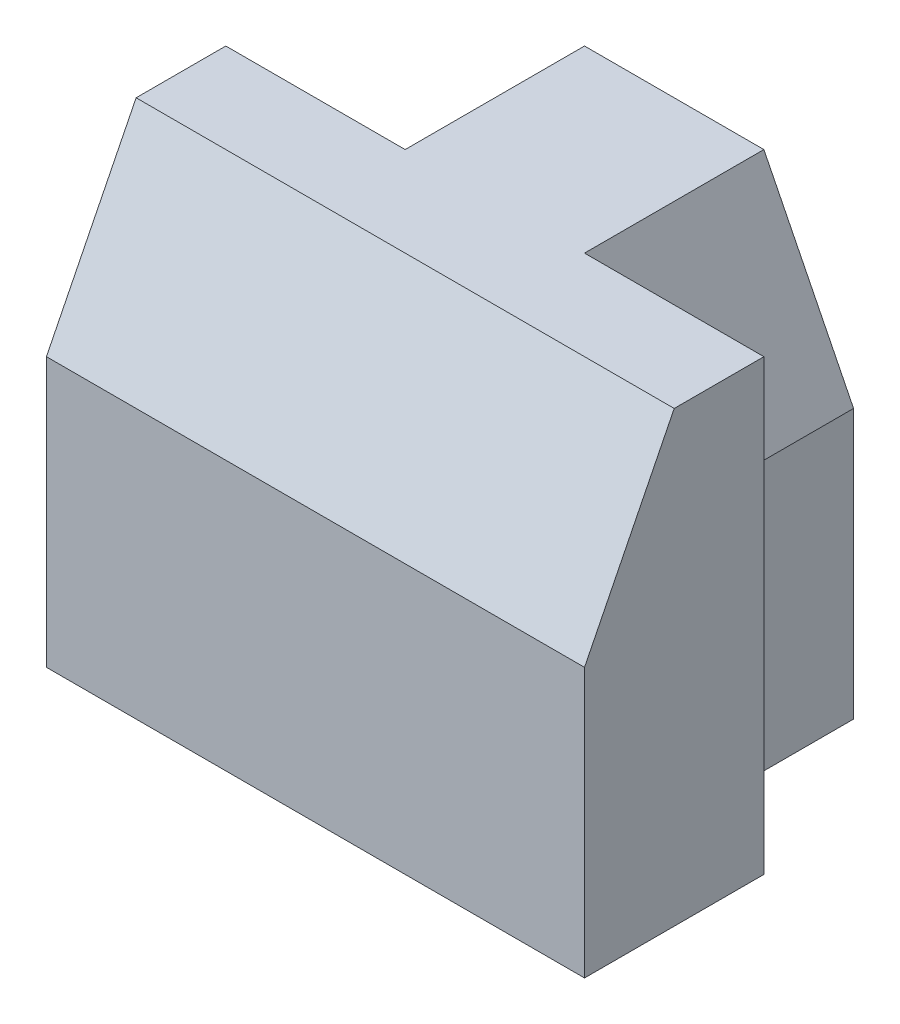
ISO-10303-21;
HEADER;
FILE_DESCRIPTION(('STEP AP214'),'2;1');
FILE_NAME('part.step','',(''),(''),'','','');
FILE_SCHEMA(('AUTOMOTIVE_DESIGN { 1 0 10303 214 1 1 1 1 }'));
ENDSEC;
DATA;
#1=APPLICATION_CONTEXT('core data for automotive mechanical design processes');
#2=APPLICATION_PROTOCOL_DEFINITION('international standard','automotive_design',2000,#1);
#3=PRODUCT_CONTEXT('',#1,'mechanical');
#4=PRODUCT('Part','Part','',(#3));
#5=PRODUCT_RELATED_PRODUCT_CATEGORY('part','',(#4));
#6=PRODUCT_DEFINITION_FORMATION('','',#4);
#7=PRODUCT_DEFINITION_CONTEXT('part definition',#1,'design');
#8=PRODUCT_DEFINITION('design','',#6,#7);
#9=PRODUCT_DEFINITION_SHAPE('','',#8);
#10=(LENGTH_UNIT() NAMED_UNIT(*) SI_UNIT(.MILLI.,.METRE.));
#11=(NAMED_UNIT(*) PLANE_ANGLE_UNIT() SI_UNIT($,.RADIAN.));
#12=(NAMED_UNIT(*) SI_UNIT($,.STERADIAN.) SOLID_ANGLE_UNIT());
#13=UNCERTAINTY_MEASURE_WITH_UNIT(LENGTH_MEASURE(1.E-05),#10,'distance_accuracy_value','');
#14=(GEOMETRIC_REPRESENTATION_CONTEXT(3) GLOBAL_UNCERTAINTY_ASSIGNED_CONTEXT((#13)) GLOBAL_UNIT_ASSIGNED_CONTEXT((#10,
#11,#12)) REPRESENTATION_CONTEXT('',''));
#15=CARTESIAN_POINT('',(0.,0.,0.));
#16=DIRECTION('',(0.,0.,1.));
#17=DIRECTION('',(1.,0.,0.));
#18=AXIS2_PLACEMENT_3D('',#15,#16,#17);
#19=CARTESIAN_POINT('',(0.,0.,20.));
#20=DIRECTION('',(1.,0.,0.));
#21=DIRECTION('',(0.,0.,-1.));
#22=AXIS2_PLACEMENT_3D('',#19,#20,#21);
#23=PLANE('',#22);
#24=DIRECTION('',(0.,1.,0.));
#25=VECTOR('',#24,1.);
#26=CARTESIAN_POINT('',(0.,0.,10.));
#27=LINE('',#26,#25);
#28=CARTESIAN_POINT('',(0.,0.,10.));
#29=VERTEX_POINT('',#28);
#30=CARTESIAN_POINT('',(0.,25.,10.));
#31=VERTEX_POINT('',#30);
#32=EDGE_CURVE('E157',#29,#31,#27,.T.);
#33=ORIENTED_EDGE('',*,*,#32,.F.);
#34=DIRECTION('',(0.,0.,-1.));
#35=VECTOR('',#34,1.);
#36=CARTESIAN_POINT('',(0.,0.,20.));
#37=LINE('',#36,#35);
#38=CARTESIAN_POINT('',(0.,0.,20.));
#39=VERTEX_POINT('',#38);
#40=EDGE_CURVE('E40',#39,#29,#37,.T.);
#41=ORIENTED_EDGE('',*,*,#40,.F.);
#42=DIRECTION('',(0.,-1.,0.));
#43=VECTOR('',#42,1.);
#44=CARTESIAN_POINT('',(0.,0.,20.));
#45=LINE('',#44,#43);
#46=CARTESIAN_POINT('',(0.,15.,20.));
#47=VERTEX_POINT('',#46);
#48=EDGE_CURVE('E177',#47,#39,#45,.T.);
#49=ORIENTED_EDGE('',*,*,#48,.F.);
#50=DIRECTION('',(0.,-0.894427190999916,0.447213595499958));
#51=VECTOR('',#50,1.);
#52=CARTESIAN_POINT('',(0.,25.,15.));
#53=LINE('',#52,#51);
#54=CARTESIAN_POINT('',(0.,25.,15.));
#55=VERTEX_POINT('',#54);
#56=EDGE_CURVE('E146',#55,#47,#53,.T.);
#57=ORIENTED_EDGE('',*,*,#56,.F.);
#58=DIRECTION('',(0.,0.,-1.));
#59=VECTOR('',#58,1.);
#60=CARTESIAN_POINT('',(0.,25.,20.));
#61=LINE('',#60,#59);
#62=EDGE_CURVE('E185',#55,#31,#61,.T.);
#63=ORIENTED_EDGE('',*,*,#62,.T.);
#64=EDGE_LOOP('',(#33,#41,#49,#57,#63));
#65=FACE_BOUND('',#64,.T.);
#66=ADVANCED_FACE('F33',(#65),#23,.F.);
#67=CARTESIAN_POINT('',(0.,0.,20.));
#68=DIRECTION('',(0.,1.,0.));
#69=DIRECTION('',(0.,0.,1.));
#70=AXIS2_PLACEMENT_3D('',#67,#68,#69);
#71=PLANE('',#70);
#72=DIRECTION('',(0.,0.,-1.));
#73=VECTOR('',#72,1.);
#74=CARTESIAN_POINT('',(25.,0.,10.));
#75=LINE('',#74,#73);
#76=CARTESIAN_POINT('',(25.,0.,10.));
#77=VERTEX_POINT('',#76);
#78=CARTESIAN_POINT('',(25.,0.,0.));
#79=VERTEX_POINT('',#78);
#80=EDGE_CURVE('E144',#77,#79,#75,.T.);
#81=ORIENTED_EDGE('',*,*,#80,.F.);
#82=DIRECTION('',(-1.,0.,0.));
#83=VECTOR('',#82,1.);
#84=CARTESIAN_POINT('',(0.,0.,10.));
#85=LINE('',#84,#83);
#86=CARTESIAN_POINT('',(30.,0.,10.));
#87=VERTEX_POINT('',#86);
#88=EDGE_CURVE('E129',#87,#77,#85,.T.);
#89=ORIENTED_EDGE('',*,*,#88,.F.);
#90=DIRECTION('',(0.,0.,-1.));
#91=VECTOR('',#90,1.);
#92=CARTESIAN_POINT('',(30.,0.,20.));
#93=LINE('',#92,#91);
#94=CARTESIAN_POINT('',(30.,0.,20.));
#95=VERTEX_POINT('',#94);
#96=EDGE_CURVE('E195',#95,#87,#93,.T.);
#97=ORIENTED_EDGE('',*,*,#96,.F.);
#98=DIRECTION('',(1.,0.,0.));
#99=VECTOR('',#98,1.);
#100=CARTESIAN_POINT('',(0.,0.,20.));
#101=LINE('',#100,#99);
#102=EDGE_CURVE('E179',#39,#95,#101,.T.);
#103=ORIENTED_EDGE('',*,*,#102,.F.);
#104=ORIENTED_EDGE('',*,*,#40,.T.);
#105=DIRECTION('',(-1.,0.,0.));
#106=VECTOR('',#105,1.);
#107=CARTESIAN_POINT('',(0.,0.,10.));
#108=LINE('',#107,#106);
#109=CARTESIAN_POINT('',(5.,0.,10.));
#110=VERTEX_POINT('',#109);
#111=EDGE_CURVE('E155',#110,#29,#108,.T.);
#112=ORIENTED_EDGE('',*,*,#111,.F.);
#113=DIRECTION('',(0.,0.,-1.));
#114=VECTOR('',#113,1.);
#115=CARTESIAN_POINT('',(5.,0.,10.));
#116=LINE('',#115,#114);
#117=CARTESIAN_POINT('',(5.,0.,0.));
#118=VERTEX_POINT('',#117);
#119=EDGE_CURVE('E166',#110,#118,#116,.T.);
#120=ORIENTED_EDGE('',*,*,#119,.T.);
#121=DIRECTION('',(1.,0.,0.));
#122=VECTOR('',#121,1.);
#123=CARTESIAN_POINT('',(0.,0.,0.));
#124=LINE('',#123,#122);
#125=EDGE_CURVE('E176',#118,#79,#124,.T.);
#126=ORIENTED_EDGE('',*,*,#125,.T.);
#127=EDGE_LOOP('',(#81,#89,#97,#103,#104,#112,#120,#126));
#128=FACE_BOUND('',#127,.T.);
#129=ADVANCED_FACE('F202',(#128),#71,.F.);
#130=CARTESIAN_POINT('',(30.,0.,20.));
#131=DIRECTION('',(-1.,0.,0.));
#132=DIRECTION('',(0.,0.,1.));
#133=AXIS2_PLACEMENT_3D('',#130,#131,#132);
#134=PLANE('',#133);
#135=DIRECTION('',(0.,-1.,0.));
#136=VECTOR('',#135,1.);
#137=CARTESIAN_POINT('',(30.,0.,10.));
#138=LINE('',#137,#136);
#139=CARTESIAN_POINT('',(30.,25.,10.));
#140=VERTEX_POINT('',#139);
#141=EDGE_CURVE('E139',#140,#87,#138,.T.);
#142=ORIENTED_EDGE('',*,*,#141,.F.);
#143=DIRECTION('',(0.,0.,-1.));
#144=VECTOR('',#143,1.);
#145=CARTESIAN_POINT('',(30.,25.,20.));
#146=LINE('',#145,#144);
#147=CARTESIAN_POINT('',(30.,25.,15.));
#148=VERTEX_POINT('',#147);
#149=EDGE_CURVE('E192',#148,#140,#146,.T.);
#150=ORIENTED_EDGE('',*,*,#149,.F.);
#151=DIRECTION('',(0.,-0.894427190999916,0.447213595499958));
#152=VECTOR('',#151,1.);
#153=CARTESIAN_POINT('',(30.,3.,26.));
#154=LINE('',#153,#152);
#155=CARTESIAN_POINT('',(30.,15.,20.));
#156=VERTEX_POINT('',#155);
#157=EDGE_CURVE('E173',#148,#156,#154,.T.);
#158=ORIENTED_EDGE('',*,*,#157,.T.);
#159=DIRECTION('',(0.,1.,0.));
#160=VECTOR('',#159,1.);
#161=CARTESIAN_POINT('',(30.,0.,20.));
#162=LINE('',#161,#160);
#163=EDGE_CURVE('E182',#95,#156,#162,.T.);
#164=ORIENTED_EDGE('',*,*,#163,.F.);
#165=ORIENTED_EDGE('',*,*,#96,.T.);
#166=EDGE_LOOP('',(#142,#150,#158,#164,#165));
#167=FACE_BOUND('',#166,.T.);
#168=ADVANCED_FACE('F228',(#167),#134,.F.);
#169=CARTESIAN_POINT('',(0.,25.,20.));
#170=DIRECTION('',(0.,-1.,0.));
#171=DIRECTION('',(0.,0.,-1.));
#172=AXIS2_PLACEMENT_3D('',#169,#170,#171);
#173=PLANE('',#172);
#174=DIRECTION('',(0.,0.,-1.));
#175=VECTOR('',#174,1.);
#176=CARTESIAN_POINT('',(20.,25.,10.));
#177=LINE('',#176,#175);
#178=CARTESIAN_POINT('',(20.,25.,10.));
#179=VERTEX_POINT('',#178);
#180=CARTESIAN_POINT('',(20.,25.,0.));
#181=VERTEX_POINT('',#180);
#182=EDGE_CURVE('E120',#179,#181,#177,.T.);
#183=ORIENTED_EDGE('',*,*,#182,.T.);
#184=DIRECTION('',(-1.,0.,0.));
#185=VECTOR('',#184,1.);
#186=CARTESIAN_POINT('',(0.,25.,0.));
#187=LINE('',#186,#185);
#188=CARTESIAN_POINT('',(10.,25.,0.));
#189=VERTEX_POINT('',#188);
#190=EDGE_CURVE('E180',#181,#189,#187,.T.);
#191=ORIENTED_EDGE('',*,*,#190,.T.);
#192=DIRECTION('',(0.,0.,-1.));
#193=VECTOR('',#192,1.);
#194=CARTESIAN_POINT('',(10.,25.,10.));
#195=LINE('',#194,#193);
#196=CARTESIAN_POINT('',(10.,25.,10.));
#197=VERTEX_POINT('',#196);
#198=EDGE_CURVE('E142',#197,#189,#195,.T.);
#199=ORIENTED_EDGE('',*,*,#198,.F.);
#200=DIRECTION('',(1.,0.,0.));
#201=VECTOR('',#200,1.);
#202=CARTESIAN_POINT('',(0.,25.,10.));
#203=LINE('',#202,#201);
#204=EDGE_CURVE('E159',#31,#197,#203,.T.);
#205=ORIENTED_EDGE('',*,*,#204,.F.);
#206=ORIENTED_EDGE('',*,*,#62,.F.);
#207=DIRECTION('',(-1.,0.,0.));
#208=VECTOR('',#207,1.);
#209=CARTESIAN_POINT('',(50.,25.,15.));
#210=LINE('',#209,#208);
#211=EDGE_CURVE('E171',#148,#55,#210,.T.);
#212=ORIENTED_EDGE('',*,*,#211,.F.);
#213=ORIENTED_EDGE('',*,*,#149,.T.);
#214=DIRECTION('',(1.,0.,0.));
#215=VECTOR('',#214,1.);
#216=CARTESIAN_POINT('',(0.,25.,10.));
#217=LINE('',#216,#215);
#218=EDGE_CURVE('E124',#179,#140,#217,.T.);
#219=ORIENTED_EDGE('',*,*,#218,.F.);
#220=EDGE_LOOP('',(#183,#191,#199,#205,#206,#212,#213,#219));
#221=FACE_BOUND('',#220,.T.);
#222=ADVANCED_FACE('F214',(#221),#173,.F.);
#223=CARTESIAN_POINT('',(0.,0.,0.));
#224=DIRECTION('',(0.,0.,-1.));
#225=DIRECTION('',(-1.,0.,0.));
#226=AXIS2_PLACEMENT_3D('',#223,#224,#225);
#227=PLANE('',#226);
#228=DIRECTION('',(0.447213595499958,-0.894427190999916,0.));
#229=VECTOR('',#228,1.);
#230=CARTESIAN_POINT('',(26.,13.,0.));
#231=LINE('',#230,#229);
#232=CARTESIAN_POINT('',(25.,15.,0.));
#233=VERTEX_POINT('',#232);
#234=EDGE_CURVE('E134',#181,#233,#231,.T.);
#235=ORIENTED_EDGE('',*,*,#234,.T.);
#236=DIRECTION('',(0.,-1.,0.));
#237=VECTOR('',#236,1.);
#238=CARTESIAN_POINT('',(25.,0.,0.));
#239=LINE('',#238,#237);
#240=EDGE_CURVE('E47',#233,#79,#239,.T.);
#241=ORIENTED_EDGE('',*,*,#240,.T.);
#242=ORIENTED_EDGE('',*,*,#125,.F.);
#243=DIRECTION('',(0.,-1.,0.));
#244=VECTOR('',#243,1.);
#245=CARTESIAN_POINT('',(5.,0.,0.));
#246=LINE('',#245,#244);
#247=CARTESIAN_POINT('',(5.,15.,0.));
#248=VERTEX_POINT('',#247);
#249=EDGE_CURVE('E152',#248,#118,#246,.T.);
#250=ORIENTED_EDGE('',*,*,#249,.F.);
#251=DIRECTION('',(-0.447213595499958,-0.894427190999916,0.));
#252=VECTOR('',#251,1.);
#253=CARTESIAN_POINT('',(-2.,0.999999999999999,0.));
#254=LINE('',#253,#252);
#255=EDGE_CURVE('E55',#189,#248,#254,.T.);
#256=ORIENTED_EDGE('',*,*,#255,.F.);
#257=ORIENTED_EDGE('',*,*,#190,.F.);
#258=EDGE_LOOP('',(#235,#241,#242,#250,#256,#257));
#259=FACE_BOUND('',#258,.T.);
#260=ADVANCED_FACE('F220',(#259),#227,.T.);
#261=CARTESIAN_POINT('',(0.,0.,20.));
#262=DIRECTION('',(0.,0.,-1.));
#263=DIRECTION('',(-1.,0.,0.));
#264=AXIS2_PLACEMENT_3D('',#261,#262,#263);
#265=PLANE('',#264);
#266=ORIENTED_EDGE('',*,*,#163,.T.);
#267=DIRECTION('',(-1.,0.,0.));
#268=VECTOR('',#267,1.);
#269=CARTESIAN_POINT('',(0.,15.,20.));
#270=LINE('',#269,#268);
#271=EDGE_CURVE('E11',#156,#47,#270,.T.);
#272=ORIENTED_EDGE('',*,*,#271,.T.);
#273=ORIENTED_EDGE('',*,*,#48,.T.);
#274=ORIENTED_EDGE('',*,*,#102,.T.);
#275=EDGE_LOOP('',(#266,#272,#273,#274));
#276=FACE_BOUND('',#275,.T.);
#277=ADVANCED_FACE('F231',(#276),#265,.F.);
#278=CARTESIAN_POINT('',(50.,25.,15.));
#279=DIRECTION('',(0.,-0.447213595499958,-0.894427190999916));
#280=DIRECTION('',(0.,0.894427190999916,-0.447213595499958));
#281=AXIS2_PLACEMENT_3D('',#278,#279,#280);
#282=PLANE('',#281);
#283=ORIENTED_EDGE('',*,*,#211,.T.);
#284=ORIENTED_EDGE('',*,*,#56,.T.);
#285=ORIENTED_EDGE('',*,*,#271,.F.);
#286=ORIENTED_EDGE('',*,*,#157,.F.);
#287=EDGE_LOOP('',(#283,#284,#285,#286));
#288=FACE_BOUND('',#287,.T.);
#289=ADVANCED_FACE('F233',(#288),#282,.F.);
#290=CARTESIAN_POINT('',(-2.,0.999999999999999,10.));
#291=DIRECTION('',(0.894427190999916,-0.447213595499958,0.));
#292=DIRECTION('',(0.447213595499958,0.894427190999916,0.));
#293=AXIS2_PLACEMENT_3D('',#290,#291,#292);
#294=PLANE('',#293);
#295=ORIENTED_EDGE('',*,*,#255,.T.);
#296=DIRECTION('',(0.,0.,-1.));
#297=VECTOR('',#296,1.);
#298=CARTESIAN_POINT('',(5.,15.,10.));
#299=LINE('',#298,#297);
#300=CARTESIAN_POINT('',(5.,15.,10.));
#301=VERTEX_POINT('',#300);
#302=EDGE_CURVE('E162',#301,#248,#299,.T.);
#303=ORIENTED_EDGE('',*,*,#302,.F.);
#304=DIRECTION('',(-0.447213595499958,-0.894427190999916,0.));
#305=VECTOR('',#304,1.);
#306=CARTESIAN_POINT('',(-2.,0.999999999999999,10.));
#307=LINE('',#306,#305);
#308=EDGE_CURVE('E148',#197,#301,#307,.T.);
#309=ORIENTED_EDGE('',*,*,#308,.F.);
#310=ORIENTED_EDGE('',*,*,#198,.T.);
#311=EDGE_LOOP('',(#295,#303,#309,#310));
#312=FACE_BOUND('',#311,.T.);
#313=ADVANCED_FACE('F217',(#312),#294,.F.);
#314=CARTESIAN_POINT('',(5.,0.,10.));
#315=DIRECTION('',(1.,0.,0.));
#316=DIRECTION('',(0.,1.,0.));
#317=AXIS2_PLACEMENT_3D('',#314,#315,#316);
#318=PLANE('',#317);
#319=ORIENTED_EDGE('',*,*,#249,.T.);
#320=ORIENTED_EDGE('',*,*,#119,.F.);
#321=DIRECTION('',(0.,-1.,0.));
#322=VECTOR('',#321,1.);
#323=CARTESIAN_POINT('',(5.,0.,10.));
#324=LINE('',#323,#322);
#325=EDGE_CURVE('E151',#301,#110,#324,.T.);
#326=ORIENTED_EDGE('',*,*,#325,.F.);
#327=ORIENTED_EDGE('',*,*,#302,.T.);
#328=EDGE_LOOP('',(#319,#320,#326,#327));
#329=FACE_BOUND('',#328,.T.);
#330=ADVANCED_FACE('F223',(#329),#318,.F.);
#331=CARTESIAN_POINT('',(0.,0.,10.));
#332=DIRECTION('',(0.,0.,-1.));
#333=DIRECTION('',(-1.,0.,0.));
#334=AXIS2_PLACEMENT_3D('',#331,#332,#333);
#335=PLANE('',#334);
#336=ORIENTED_EDGE('',*,*,#308,.T.);
#337=ORIENTED_EDGE('',*,*,#325,.T.);
#338=ORIENTED_EDGE('',*,*,#111,.T.);
#339=ORIENTED_EDGE('',*,*,#32,.T.);
#340=ORIENTED_EDGE('',*,*,#204,.T.);
#341=EDGE_LOOP('',(#336,#337,#338,#339,#340));
#342=FACE_BOUND('',#341,.T.);
#343=ADVANCED_FACE('F211',(#342),#335,.T.);
#344=CARTESIAN_POINT('',(25.,0.,10.));
#345=DIRECTION('',(1.,0.,0.));
#346=DIRECTION('',(0.,1.,0.));
#347=AXIS2_PLACEMENT_3D('',#344,#345,#346);
#348=PLANE('',#347);
#349=ORIENTED_EDGE('',*,*,#240,.F.);
#350=DIRECTION('',(0.,0.,-1.));
#351=VECTOR('',#350,1.);
#352=CARTESIAN_POINT('',(25.,15.,10.));
#353=LINE('',#352,#351);
#354=CARTESIAN_POINT('',(25.,15.,10.));
#355=VERTEX_POINT('',#354);
#356=EDGE_CURVE('E117',#355,#233,#353,.T.);
#357=ORIENTED_EDGE('',*,*,#356,.F.);
#358=DIRECTION('',(0.,-1.,0.));
#359=VECTOR('',#358,1.);
#360=CARTESIAN_POINT('',(25.,0.,10.));
#361=LINE('',#360,#359);
#362=EDGE_CURVE('E125',#355,#77,#361,.T.);
#363=ORIENTED_EDGE('',*,*,#362,.T.);
#364=ORIENTED_EDGE('',*,*,#80,.T.);
#365=EDGE_LOOP('',(#349,#357,#363,#364));
#366=FACE_BOUND('',#365,.T.);
#367=ADVANCED_FACE('F127',(#366),#348,.T.);
#368=CARTESIAN_POINT('',(26.,13.,10.));
#369=DIRECTION('',(0.894427190999916,0.447213595499958,0.));
#370=DIRECTION('',(-0.447213595499958,0.894427190999916,0.));
#371=AXIS2_PLACEMENT_3D('',#368,#369,#370);
#372=PLANE('',#371);
#373=ORIENTED_EDGE('',*,*,#234,.F.);
#374=ORIENTED_EDGE('',*,*,#182,.F.);
#375=DIRECTION('',(0.447213595499958,-0.894427190999916,0.));
#376=VECTOR('',#375,1.);
#377=CARTESIAN_POINT('',(26.,13.,10.));
#378=LINE('',#377,#376);
#379=EDGE_CURVE('E115',#179,#355,#378,.T.);
#380=ORIENTED_EDGE('',*,*,#379,.T.);
#381=ORIENTED_EDGE('',*,*,#356,.T.);
#382=EDGE_LOOP('',(#373,#374,#380,#381));
#383=FACE_BOUND('',#382,.T.);
#384=ADVANCED_FACE('F116',(#383),#372,.T.);
#385=CARTESIAN_POINT('',(0.,0.,10.));
#386=DIRECTION('',(0.,0.,-1.));
#387=DIRECTION('',(-1.,0.,0.));
#388=AXIS2_PLACEMENT_3D('',#385,#386,#387);
#389=PLANE('',#388);
#390=ORIENTED_EDGE('',*,*,#362,.F.);
#391=ORIENTED_EDGE('',*,*,#379,.F.);
#392=ORIENTED_EDGE('',*,*,#218,.T.);
#393=ORIENTED_EDGE('',*,*,#141,.T.);
#394=ORIENTED_EDGE('',*,*,#88,.T.);
#395=EDGE_LOOP('',(#390,#391,#392,#393,#394));
#396=FACE_BOUND('',#395,.T.);
#397=ADVANCED_FACE('F131',(#396),#389,.T.);
#398=CLOSED_SHELL('',(#66,#129,#168,#222,#260,#277,#289,#313,#330,#343,#367,#384,#397));
#399=MANIFOLD_SOLID_BREP('B2',#398);
#400=ADVANCED_BREP_SHAPE_REPRESENTATION('',(#18,#399),#14);
#401=SHAPE_DEFINITION_REPRESENTATION(#9,#400);
ENDSEC;
END-ISO-10303-21;
